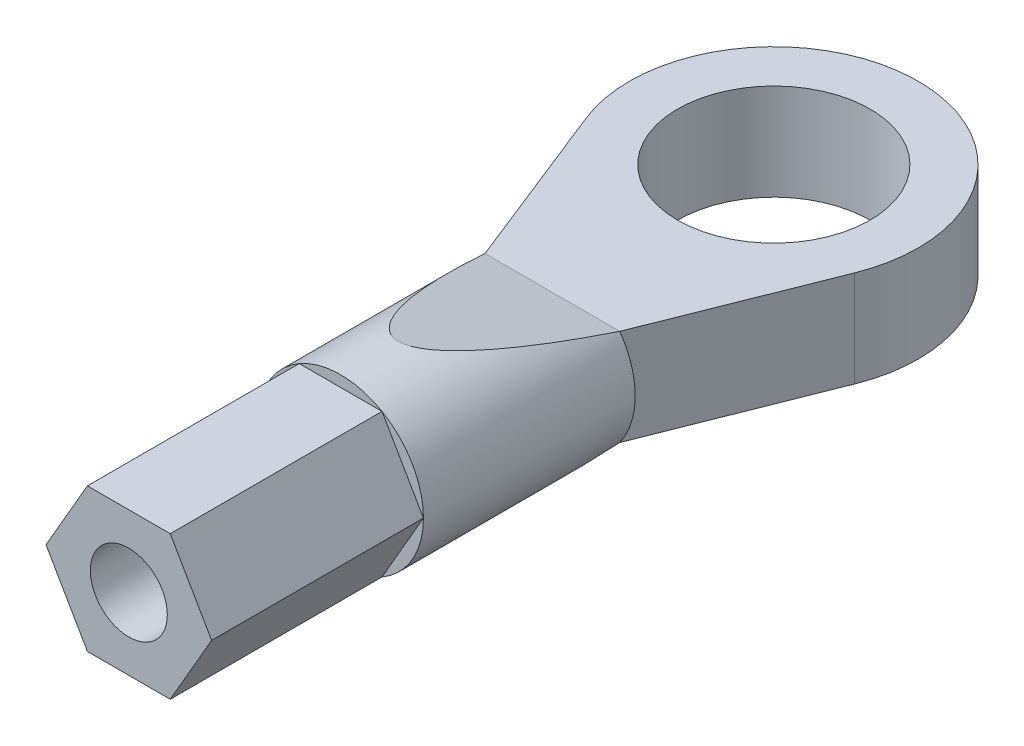
ISO-10303-21;
HEADER;
FILE_DESCRIPTION(('STEP AP214'),'2;1');
FILE_NAME('part.step','',(''),(''),'','','');
FILE_SCHEMA(('AUTOMOTIVE_DESIGN { 1 0 10303 214 1 1 1 1 }'));
ENDSEC;
DATA;
#1=APPLICATION_CONTEXT('core data for automotive mechanical design processes');
#2=APPLICATION_PROTOCOL_DEFINITION('international standard','automotive_design',2000,#1);
#3=PRODUCT_CONTEXT('',#1,'mechanical');
#4=PRODUCT('Part','Part','',(#3));
#5=PRODUCT_RELATED_PRODUCT_CATEGORY('part','',(#4));
#6=PRODUCT_DEFINITION_FORMATION('','',#4);
#7=PRODUCT_DEFINITION_CONTEXT('part definition',#1,'design');
#8=PRODUCT_DEFINITION('design','',#6,#7);
#9=PRODUCT_DEFINITION_SHAPE('','',#8);
#10=(LENGTH_UNIT() NAMED_UNIT(*) SI_UNIT(.MILLI.,.METRE.));
#11=(NAMED_UNIT(*) PLANE_ANGLE_UNIT() SI_UNIT($,.RADIAN.));
#12=(NAMED_UNIT(*) SI_UNIT($,.STERADIAN.) SOLID_ANGLE_UNIT());
#13=UNCERTAINTY_MEASURE_WITH_UNIT(LENGTH_MEASURE(1.E-05),#10,'distance_accuracy_value','');
#14=(GEOMETRIC_REPRESENTATION_CONTEXT(3) GLOBAL_UNCERTAINTY_ASSIGNED_CONTEXT((#13)) GLOBAL_UNIT_ASSIGNED_CONTEXT((#10,
#11,#12)) REPRESENTATION_CONTEXT('',''));
#15=CARTESIAN_POINT('',(0.,0.,0.));
#16=DIRECTION('',(0.,0.,1.));
#17=DIRECTION('',(1.,0.,0.));
#18=AXIS2_PLACEMENT_3D('',#15,#16,#17);
#19=CARTESIAN_POINT('',(0.,1.25,11.25));
#20=DIRECTION('',(0.,0.,1.));
#21=DIRECTION('',(1.,0.,0.));
#22=AXIS2_PLACEMENT_3D('',#19,#20,#21);
#23=PLANE('',#22);
#24=DIRECTION('',(0.499999999999995,0.866025403784441,0.));
#25=VECTOR('',#24,1.);
#26=CARTESIAN_POINT('',(1.07529065838035,-0.612458053218905,11.25));
#27=LINE('',#26,#25);
#28=CARTESIAN_POINT('',(1.07529065838035,-0.612458053218905,11.25));
#29=VERTEX_POINT('',#28);
#30=CARTESIAN_POINT('',(2.15058131676066,1.25,11.25));
#31=VERTEX_POINT('',#30);
#32=EDGE_CURVE('E81',#29,#31,#27,.T.);
#33=ORIENTED_EDGE('',*,*,#32,.F.);
#34=CARTESIAN_POINT('',(0.,1.25,11.25));
#35=DIRECTION('',(0.,0.,1.));
#36=DIRECTION('',(1.,0.,0.));
#37=AXIS2_PLACEMENT_3D('',#34,#35,#36);
#38=CIRCLE('',#37,2.15058131676066);
#39=EDGE_CURVE('E190',#29,#31,#38,.T.);
#40=ORIENTED_EDGE('',*,*,#39,.T.);
#41=EDGE_LOOP('',(#33,#40));
#42=FACE_BOUND('',#41,.T.);
#43=ADVANCED_FACE('F66',(#42),#23,.T.);
#44=DIRECTION('',(1.,0.,0.));
#45=VECTOR('',#44,1.);
#46=CARTESIAN_POINT('',(-1.07529065838031,-0.612458053218927,11.25));
#47=LINE('',#46,#45);
#48=CARTESIAN_POINT('',(-1.07529065838031,-0.612458053218927,11.25));
#49=VERTEX_POINT('',#48);
#50=EDGE_CURVE('E88',#49,#29,#47,.T.);
#51=ORIENTED_EDGE('',*,*,#50,.F.);
#52=EDGE_CURVE('E624',#49,#29,#38,.T.);
#53=ORIENTED_EDGE('',*,*,#52,.T.);
#54=EDGE_LOOP('',(#51,#53));
#55=FACE_BOUND('',#54,.T.);
#56=ADVANCED_FACE('F286',(#55),#23,.T.);
#57=DIRECTION('',(0.500000000000004,-0.866025403784436,0.));
#58=VECTOR('',#57,1.);
#59=CARTESIAN_POINT('',(-2.15058131676066,1.25,11.25));
#60=LINE('',#59,#58);
#61=CARTESIAN_POINT('',(-2.15058131676066,1.25,11.25));
#62=VERTEX_POINT('',#61);
#63=EDGE_CURVE('E352',#62,#49,#60,.T.);
#64=ORIENTED_EDGE('',*,*,#63,.F.);
#65=EDGE_CURVE('E619',#62,#49,#38,.T.);
#66=ORIENTED_EDGE('',*,*,#65,.T.);
#67=EDGE_LOOP('',(#64,#66));
#68=FACE_BOUND('',#67,.T.);
#69=ADVANCED_FACE('F290',(#68),#23,.T.);
#70=DIRECTION('',(-0.499999999999998,-0.86602540378444,0.));
#71=VECTOR('',#70,1.);
#72=CARTESIAN_POINT('',(-1.07529065838034,3.11245805321891,11.25));
#73=LINE('',#72,#71);
#74=CARTESIAN_POINT('',(-1.07529065838034,3.11245805321891,11.25));
#75=VERTEX_POINT('',#74);
#76=EDGE_CURVE('E327',#75,#62,#73,.T.);
#77=ORIENTED_EDGE('',*,*,#76,.F.);
#78=EDGE_CURVE('E623',#75,#62,#38,.T.);
#79=ORIENTED_EDGE('',*,*,#78,.T.);
#80=EDGE_LOOP('',(#77,#79));
#81=FACE_BOUND('',#80,.T.);
#82=ADVANCED_FACE('F309',(#81),#23,.T.);
#83=DIRECTION('',(-1.,0.,0.));
#84=VECTOR('',#83,1.);
#85=CARTESIAN_POINT('',(1.07529065838032,3.11245805321892,11.25));
#86=LINE('',#85,#84);
#87=CARTESIAN_POINT('',(1.07529065838032,3.11245805321892,11.25));
#88=VERTEX_POINT('',#87);
#89=EDGE_CURVE('E321',#88,#75,#86,.T.);
#90=ORIENTED_EDGE('',*,*,#89,.F.);
#91=EDGE_CURVE('E189',#88,#75,#38,.T.);
#92=ORIENTED_EDGE('',*,*,#91,.T.);
#93=EDGE_LOOP('',(#90,#92));
#94=FACE_BOUND('',#93,.T.);
#95=ADVANCED_FACE('F300',(#94),#23,.T.);
#96=CARTESIAN_POINT('',(0.,1.25,11.25));
#97=DIRECTION('',(0.,0.,-1.));
#98=DIRECTION('',(-1.,0.,0.));
#99=AXIS2_PLACEMENT_3D('',#96,#97,#98);
#100=CYLINDRICAL_SURFACE('',#99,2.15058131676066);
#101=EDGE_CURVE('E185',#31,#88,#38,.T.);
#102=ORIENTED_EDGE('',*,*,#101,.F.);
#103=ORIENTED_EDGE('',*,*,#39,.F.);
#104=ORIENTED_EDGE('',*,*,#52,.F.);
#105=ORIENTED_EDGE('',*,*,#65,.F.);
#106=ORIENTED_EDGE('',*,*,#78,.F.);
#107=ORIENTED_EDGE('',*,*,#91,.F.);
#108=EDGE_LOOP('',(#102,#103,#104,#105,#106,#107));
#109=FACE_BOUND('',#108,.T.);
#110=CARTESIAN_POINT('',(0.,1.25,0.198030503247907));
#111=DIRECTION('',(0.,-0.975579383374607,-0.219647141421013));
#112=DIRECTION('',(0.,0.219647141421013,-0.975579383374607));
#113=AXIS2_PLACEMENT_3D('',#110,#111,#112);
#114=ELLIPSE('',#113,9.79107355027437,2.15058131676066);
#115=CARTESIAN_POINT('',(1.75,0.,5.75));
#116=VERTEX_POINT('',#115);
#117=CARTESIAN_POINT('',(-1.75,0.,5.75));
#118=VERTEX_POINT('',#117);
#119=EDGE_CURVE('E176',#116,#118,#114,.T.);
#120=ORIENTED_EDGE('',*,*,#119,.F.);
#121=CARTESIAN_POINT('',(0.,1.25,5.75));
#122=DIRECTION('',(0.,0.,1.));
#123=DIRECTION('',(1.,0.,0.));
#124=AXIS2_PLACEMENT_3D('',#121,#122,#123);
#125=CIRCLE('',#124,2.15058131676066);
#126=CARTESIAN_POINT('',(1.75,2.5,5.75));
#127=VERTEX_POINT('',#126);
#128=EDGE_CURVE('E184',#116,#127,#125,.T.);
#129=ORIENTED_EDGE('',*,*,#128,.T.);
#130=CARTESIAN_POINT('',(0.,1.25,0.198030503247902));
#131=DIRECTION('',(0.,0.975579383374607,-0.219647141421013));
#132=DIRECTION('',(0.,-0.219647141421013,-0.975579383374607));
#133=AXIS2_PLACEMENT_3D('',#130,#131,#132);
#134=ELLIPSE('',#133,9.79107355027438,2.15058131676066);
#135=CARTESIAN_POINT('',(-1.75,2.5,5.75));
#136=VERTEX_POINT('',#135);
#137=EDGE_CURVE('E172',#136,#127,#134,.T.);
#138=ORIENTED_EDGE('',*,*,#137,.F.);
#139=EDGE_CURVE('E194',#136,#118,#125,.T.);
#140=ORIENTED_EDGE('',*,*,#139,.T.);
#141=EDGE_LOOP('',(#120,#129,#138,#140));
#142=FACE_BOUND('',#141,.T.);
#143=ADVANCED_FACE('F255',(#109,#142),#100,.T.);
#144=CARTESIAN_POINT('',(-3.48484494320039,2.5,1.38504719119988));
#145=DIRECTION('',(-0.929291984853437,0.,0.369345917653302));
#146=DIRECTION('',(0.369345917653302,0.,0.929291984853437));
#147=AXIS2_PLACEMENT_3D('',#144,#145,#146);
#148=PLANE('',#147);
#149=DIRECTION('',(-0.369345917653302,0.,-0.929291984853437));
#150=VECTOR('',#149,1.);
#151=CARTESIAN_POINT('',(-3.48484494320039,0.,1.38504719119988));
#152=LINE('',#151,#150);
#153=CARTESIAN_POINT('',(-3.48484494320039,0.,1.38504719119988));
#154=VERTEX_POINT('',#153);
#155=EDGE_CURVE('E188',#118,#154,#152,.T.);
#156=ORIENTED_EDGE('',*,*,#155,.F.);
#157=DIRECTION('',(0.,-1.,0.));
#158=VECTOR('',#157,1.);
#159=CARTESIAN_POINT('',(-1.75,2.5,5.75));
#160=LINE('',#159,#158);
#161=EDGE_CURVE('E12',#136,#118,#160,.T.);
#162=ORIENTED_EDGE('',*,*,#161,.F.);
#163=DIRECTION('',(-0.369345917653302,0.,-0.929291984853437));
#164=VECTOR('',#163,1.);
#165=CARTESIAN_POINT('',(-3.48484494320039,2.5,1.38504719119988));
#166=LINE('',#165,#164);
#167=CARTESIAN_POINT('',(-3.48484494320039,2.5,1.38504719119988));
#168=VERTEX_POINT('',#167);
#169=EDGE_CURVE('E195',#136,#168,#166,.T.);
#170=ORIENTED_EDGE('',*,*,#169,.T.);
#171=DIRECTION('',(0.,-1.,0.));
#172=VECTOR('',#171,1.);
#173=CARTESIAN_POINT('',(-3.48484494320039,2.5,1.38504719119988));
#174=LINE('',#173,#172);
#175=EDGE_CURVE('E214',#168,#154,#174,.T.);
#176=ORIENTED_EDGE('',*,*,#175,.T.);
#177=EDGE_LOOP('',(#156,#162,#170,#176));
#178=FACE_BOUND('',#177,.T.);
#179=ADVANCED_FACE('F68',(#178),#148,.T.);
#180=CARTESIAN_POINT('',(3.48484494320039,2.5,1.38504719119988));
#181=DIRECTION('',(-0.929291984853437,0.,-0.369345917653302));
#182=DIRECTION('',(-0.369345917653302,0.,0.929291984853437));
#183=AXIS2_PLACEMENT_3D('',#180,#181,#182);
#184=PLANE('',#183);
#185=DIRECTION('',(0.369345917653302,0.,-0.929291984853437));
#186=VECTOR('',#185,1.);
#187=CARTESIAN_POINT('',(3.48484494320039,0.,1.38504719119988));
#188=LINE('',#187,#186);
#189=CARTESIAN_POINT('',(3.48484494320039,0.,1.38504719119988));
#190=VERTEX_POINT('',#189);
#191=EDGE_CURVE('E221',#116,#190,#188,.T.);
#192=ORIENTED_EDGE('',*,*,#191,.T.);
#193=DIRECTION('',(0.,-1.,0.));
#194=VECTOR('',#193,1.);
#195=CARTESIAN_POINT('',(3.48484494320039,2.5,1.38504719119988));
#196=LINE('',#195,#194);
#197=CARTESIAN_POINT('',(3.48484494320039,2.5,1.38504719119988));
#198=VERTEX_POINT('',#197);
#199=EDGE_CURVE('E233',#198,#190,#196,.T.);
#200=ORIENTED_EDGE('',*,*,#199,.F.);
#201=DIRECTION('',(0.369345917653302,0.,-0.929291984853437));
#202=VECTOR('',#201,1.);
#203=CARTESIAN_POINT('',(3.48484494320039,2.5,1.38504719119988));
#204=LINE('',#203,#202);
#205=EDGE_CURVE('E204',#127,#198,#204,.T.);
#206=ORIENTED_EDGE('',*,*,#205,.F.);
#207=DIRECTION('',(0.,-1.,0.));
#208=VECTOR('',#207,1.);
#209=CARTESIAN_POINT('',(1.75,2.5,5.75));
#210=LINE('',#209,#208);
#211=EDGE_CURVE('E75',#127,#116,#210,.T.);
#212=ORIENTED_EDGE('',*,*,#211,.T.);
#213=EDGE_LOOP('',(#192,#200,#206,#212));
#214=FACE_BOUND('',#213,.T.);
#215=ADVANCED_FACE('F242',(#214),#184,.F.);
#216=CARTESIAN_POINT('',(0.,2.5,0.));
#217=DIRECTION('',(0.,-1.,0.));
#218=DIRECTION('',(0.,0.,-1.));
#219=AXIS2_PLACEMENT_3D('',#216,#217,#218);
#220=CYLINDRICAL_SURFACE('',#219,3.75);
#221=CARTESIAN_POINT('',(0.,0.,0.));
#222=DIRECTION('',(0.,1.,0.));
#223=DIRECTION('',(0.,0.,1.));
#224=AXIS2_PLACEMENT_3D('',#221,#222,#223);
#225=CIRCLE('',#224,3.75);
#226=EDGE_CURVE('E224',#190,#154,#225,.T.);
#227=ORIENTED_EDGE('',*,*,#226,.T.);
#228=ORIENTED_EDGE('',*,*,#175,.F.);
#229=CARTESIAN_POINT('',(0.,2.5,0.));
#230=DIRECTION('',(0.,1.,0.));
#231=DIRECTION('',(0.,0.,1.));
#232=AXIS2_PLACEMENT_3D('',#229,#230,#231);
#233=CIRCLE('',#232,3.75);
#234=EDGE_CURVE('E207',#198,#168,#233,.T.);
#235=ORIENTED_EDGE('',*,*,#234,.F.);
#236=ORIENTED_EDGE('',*,*,#199,.T.);
#237=EDGE_LOOP('',(#227,#228,#235,#236));
#238=FACE_BOUND('',#237,.T.);
#239=ADVANCED_FACE('F267',(#238),#220,.T.);
#240=CARTESIAN_POINT('',(0.,2.5,0.));
#241=DIRECTION('',(0.,-1.,0.));
#242=DIRECTION('',(0.,0.,-1.));
#243=AXIS2_PLACEMENT_3D('',#240,#241,#242);
#244=CYLINDRICAL_SURFACE('',#243,2.5);
#245=CARTESIAN_POINT('',(0.,2.5,0.));
#246=DIRECTION('',(0.,1.,0.));
#247=DIRECTION('',(0.,0.,1.));
#248=AXIS2_PLACEMENT_3D('',#245,#246,#247);
#249=CIRCLE('',#248,2.5);
#250=CARTESIAN_POINT('',(0.,2.5,2.5));
#251=VERTEX_POINT('',#250);
#252=EDGE_CURVE('E210',#251,#251,#249,.T.);
#253=ORIENTED_EDGE('',*,*,#252,.T.);
#254=EDGE_LOOP('',(#253));
#255=FACE_BOUND('',#254,.T.);
#256=CARTESIAN_POINT('',(0.,0.,0.));
#257=DIRECTION('',(0.,1.,0.));
#258=DIRECTION('',(0.,0.,1.));
#259=AXIS2_PLACEMENT_3D('',#256,#257,#258);
#260=CIRCLE('',#259,2.5);
#261=CARTESIAN_POINT('',(0.,0.,2.5));
#262=VERTEX_POINT('',#261);
#263=EDGE_CURVE('E200',#262,#262,#260,.T.);
#264=ORIENTED_EDGE('',*,*,#263,.F.);
#265=EDGE_LOOP('',(#264));
#266=FACE_BOUND('',#265,.T.);
#267=ADVANCED_FACE('F483',(#255,#266),#244,.F.);
#268=CARTESIAN_POINT('',(0.,2.5,0.));
#269=DIRECTION('',(0.,1.,0.));
#270=DIRECTION('',(0.,0.,1.));
#271=AXIS2_PLACEMENT_3D('',#268,#269,#270);
#272=PLANE('',#271);
#273=ORIENTED_EDGE('',*,*,#169,.F.);
#274=DIRECTION('',(1.,0.,0.));
#275=VECTOR('',#274,1.);
#276=CARTESIAN_POINT('',(0.,2.5,5.75));
#277=LINE('',#276,#275);
#278=EDGE_CURVE('E199',#136,#127,#277,.T.);
#279=ORIENTED_EDGE('',*,*,#278,.T.);
#280=ORIENTED_EDGE('',*,*,#205,.T.);
#281=ORIENTED_EDGE('',*,*,#234,.T.);
#282=EDGE_LOOP('',(#273,#279,#280,#281));
#283=FACE_BOUND('',#282,.T.);
#284=ORIENTED_EDGE('',*,*,#252,.F.);
#285=EDGE_LOOP('',(#284));
#286=FACE_BOUND('',#285,.T.);
#287=ADVANCED_FACE('F269',(#283,#286),#272,.T.);
#288=CARTESIAN_POINT('',(0.,0.,0.));
#289=DIRECTION('',(0.,1.,0.));
#290=DIRECTION('',(0.,0.,1.));
#291=AXIS2_PLACEMENT_3D('',#288,#289,#290);
#292=PLANE('',#291);
#293=ORIENTED_EDGE('',*,*,#155,.T.);
#294=ORIENTED_EDGE('',*,*,#226,.F.);
#295=ORIENTED_EDGE('',*,*,#191,.F.);
#296=DIRECTION('',(1.,0.,0.));
#297=VECTOR('',#296,1.);
#298=CARTESIAN_POINT('',(0.,0.,5.75));
#299=LINE('',#298,#297);
#300=EDGE_CURVE('E218',#118,#116,#299,.T.);
#301=ORIENTED_EDGE('',*,*,#300,.F.);
#302=EDGE_LOOP('',(#293,#294,#295,#301));
#303=FACE_BOUND('',#302,.T.);
#304=ORIENTED_EDGE('',*,*,#263,.T.);
#305=EDGE_LOOP('',(#304));
#306=FACE_BOUND('',#305,.T.);
#307=ADVANCED_FACE('F249',(#303,#306),#292,.F.);
#308=CARTESIAN_POINT('',(0.,1.25,5.75));
#309=DIRECTION('',(0.,0.,1.));
#310=DIRECTION('',(1.,0.,0.));
#311=AXIS2_PLACEMENT_3D('',#308,#309,#310);
#312=PLANE('',#311);
#313=ORIENTED_EDGE('',*,*,#211,.F.);
#314=ORIENTED_EDGE('',*,*,#128,.F.);
#315=EDGE_LOOP('',(#313,#314));
#316=FACE_BOUND('',#315,.T.);
#317=ADVANCED_FACE('F251',(#316),#312,.F.);
#318=DIRECTION('',(-0.500000000000001,0.866025403784438,0.));
#319=VECTOR('',#318,1.);
#320=CARTESIAN_POINT('',(2.15058131676066,1.25,11.25));
#321=LINE('',#320,#319);
#322=EDGE_CURVE('E328',#31,#88,#321,.T.);
#323=ORIENTED_EDGE('',*,*,#322,.F.);
#324=ORIENTED_EDGE('',*,*,#101,.T.);
#325=EDGE_LOOP('',(#323,#324));
#326=FACE_BOUND('',#325,.T.);
#327=ADVANCED_FACE('F281',(#326),#23,.T.);
#328=ORIENTED_EDGE('',*,*,#139,.F.);
#329=ORIENTED_EDGE('',*,*,#161,.T.);
#330=EDGE_LOOP('',(#328,#329));
#331=FACE_BOUND('',#330,.T.);
#332=ADVANCED_FACE('F274',(#331),#312,.F.);
#333=CARTESIAN_POINT('',(5.5,1.14725930213578,-0.258300073245838));
#334=DIRECTION('',(0.,0.975579383374607,-0.219647141421013));
#335=DIRECTION('',(0.,0.219647141421013,0.975579383374607));
#336=AXIS2_PLACEMENT_3D('',#333,#334,#335);
#337=PLANE('',#336);
#338=ORIENTED_EDGE('',*,*,#137,.T.);
#339=ORIENTED_EDGE('',*,*,#278,.F.);
#340=EDGE_LOOP('',(#338,#339));
#341=FACE_BOUND('',#340,.T.);
#342=ADVANCED_FACE('F272',(#341),#337,.T.);
#343=CARTESIAN_POINT('',(5.5,1.23212853102817,0.27740798372293));
#344=DIRECTION('',(0.,-0.975579383374607,-0.219647141421013));
#345=DIRECTION('',(0.,0.219647141421013,-0.975579383374607));
#346=AXIS2_PLACEMENT_3D('',#343,#344,#345);
#347=PLANE('',#346);
#348=ORIENTED_EDGE('',*,*,#119,.T.);
#349=ORIENTED_EDGE('',*,*,#300,.T.);
#350=EDGE_LOOP('',(#348,#349));
#351=FACE_BOUND('',#350,.T.);
#352=ADVANCED_FACE('F261',(#351),#347,.T.);
#353=CARTESIAN_POINT('',(0.,0.,16.75));
#354=DIRECTION('',(0.,0.,1.));
#355=DIRECTION('',(1.,0.,0.));
#356=AXIS2_PLACEMENT_3D('',#353,#354,#355);
#357=PLANE('',#356);
#358=DIRECTION('',(0.499999999999995,0.866025403784441,0.));
#359=VECTOR('',#358,1.);
#360=CARTESIAN_POINT('',(1.07529065838035,-0.612458053218905,16.75));
#361=LINE('',#360,#359);
#362=CARTESIAN_POINT('',(1.07529065838035,-0.612458053218905,16.75));
#363=VERTEX_POINT('',#362);
#364=CARTESIAN_POINT('',(2.15058131676066,1.25,16.75));
#365=VERTEX_POINT('',#364);
#366=EDGE_CURVE('E158',#363,#365,#361,.T.);
#367=ORIENTED_EDGE('',*,*,#366,.T.);
#368=DIRECTION('',(-0.500000000000001,0.866025403784438,0.));
#369=VECTOR('',#368,1.);
#370=CARTESIAN_POINT('',(2.15058131676066,1.25,16.75));
#371=LINE('',#370,#369);
#372=CARTESIAN_POINT('',(1.07529065838032,3.11245805321892,16.75));
#373=VERTEX_POINT('',#372);
#374=EDGE_CURVE('E146',#365,#373,#371,.T.);
#375=ORIENTED_EDGE('',*,*,#374,.T.);
#376=DIRECTION('',(-1.,0.,0.));
#377=VECTOR('',#376,1.);
#378=CARTESIAN_POINT('',(1.07529065838032,3.11245805321892,16.75));
#379=LINE('',#378,#377);
#380=CARTESIAN_POINT('',(-1.07529065838034,3.11245805321891,16.75));
#381=VERTEX_POINT('',#380);
#382=EDGE_CURVE('E157',#373,#381,#379,.T.);
#383=ORIENTED_EDGE('',*,*,#382,.T.);
#384=DIRECTION('',(-0.499999999999998,-0.86602540378444,0.));
#385=VECTOR('',#384,1.);
#386=CARTESIAN_POINT('',(-1.07529065838034,3.11245805321891,16.75));
#387=LINE('',#386,#385);
#388=CARTESIAN_POINT('',(-2.15058131676066,1.25,16.75));
#389=VERTEX_POINT('',#388);
#390=EDGE_CURVE('E335',#381,#389,#387,.T.);
#391=ORIENTED_EDGE('',*,*,#390,.T.);
#392=DIRECTION('',(0.500000000000004,-0.866025403784436,0.));
#393=VECTOR('',#392,1.);
#394=CARTESIAN_POINT('',(-2.15058131676066,1.25,16.75));
#395=LINE('',#394,#393);
#396=CARTESIAN_POINT('',(-1.07529065838031,-0.612458053218927,16.75));
#397=VERTEX_POINT('',#396);
#398=EDGE_CURVE('E338',#389,#397,#395,.T.);
#399=ORIENTED_EDGE('',*,*,#398,.T.);
#400=DIRECTION('',(1.,0.,0.));
#401=VECTOR('',#400,1.);
#402=CARTESIAN_POINT('',(-1.07529065838031,-0.612458053218927,16.75));
#403=LINE('',#402,#401);
#404=EDGE_CURVE('E164',#397,#363,#403,.T.);
#405=ORIENTED_EDGE('',*,*,#404,.T.);
#406=EDGE_LOOP('',(#367,#375,#383,#391,#399,#405));
#407=FACE_BOUND('',#406,.T.);
#408=CARTESIAN_POINT('',(0.,1.25,16.75));
#409=DIRECTION('',(0.,0.,1.));
#410=DIRECTION('',(1.,0.,0.));
#411=AXIS2_PLACEMENT_3D('',#408,#409,#410);
#412=CIRCLE('',#411,1.);
#413=CARTESIAN_POINT('',(1.,1.25,16.75));
#414=VERTEX_POINT('',#413);
#415=EDGE_CURVE('E347',#414,#414,#412,.T.);
#416=ORIENTED_EDGE('',*,*,#415,.F.);
#417=EDGE_LOOP('',(#416));
#418=FACE_BOUND('',#417,.T.);
#419=ADVANCED_FACE('F161',(#407,#418),#357,.T.);
#420=CARTESIAN_POINT('',(1.07529065838035,-0.612458053218905,16.75));
#421=DIRECTION('',(-0.866025403784441,0.499999999999995,0.));
#422=DIRECTION('',(-0.499999999999995,-0.866025403784441,0.));
#423=AXIS2_PLACEMENT_3D('',#420,#421,#422);
#424=PLANE('',#423);
#425=ORIENTED_EDGE('',*,*,#32,.T.);
#426=DIRECTION('',(0.,0.,-1.));
#427=VECTOR('',#426,1.);
#428=CARTESIAN_POINT('',(2.15058131676066,1.25,16.75));
#429=LINE('',#428,#427);
#430=EDGE_CURVE('E151',#365,#31,#429,.T.);
#431=ORIENTED_EDGE('',*,*,#430,.F.);
#432=ORIENTED_EDGE('',*,*,#366,.F.);
#433=DIRECTION('',(0.,0.,-1.));
#434=VECTOR('',#433,1.);
#435=CARTESIAN_POINT('',(1.07529065838035,-0.612458053218905,16.75));
#436=LINE('',#435,#434);
#437=EDGE_CURVE('E345',#363,#29,#436,.T.);
#438=ORIENTED_EDGE('',*,*,#437,.T.);
#439=EDGE_LOOP('',(#425,#431,#432,#438));
#440=FACE_BOUND('',#439,.T.);
#441=ADVANCED_FACE('F170',(#440),#424,.F.);
#442=CARTESIAN_POINT('',(2.15058131676066,1.25,16.75));
#443=DIRECTION('',(-0.866025403784438,-0.500000000000001,0.));
#444=DIRECTION('',(0.500000000000001,-0.866025403784438,0.));
#445=AXIS2_PLACEMENT_3D('',#442,#443,#444);
#446=PLANE('',#445);
#447=ORIENTED_EDGE('',*,*,#322,.T.);
#448=DIRECTION('',(0.,0.,-1.));
#449=VECTOR('',#448,1.);
#450=CARTESIAN_POINT('',(1.07529065838032,3.11245805321892,16.75));
#451=LINE('',#450,#449);
#452=EDGE_CURVE('E153',#373,#88,#451,.T.);
#453=ORIENTED_EDGE('',*,*,#452,.F.);
#454=ORIENTED_EDGE('',*,*,#374,.F.);
#455=ORIENTED_EDGE('',*,*,#430,.T.);
#456=EDGE_LOOP('',(#447,#453,#454,#455));
#457=FACE_BOUND('',#456,.T.);
#458=ADVANCED_FACE('F149',(#457),#446,.F.);
#459=CARTESIAN_POINT('',(1.07529065838032,3.11245805321892,16.75));
#460=DIRECTION('',(0.,-1.,0.));
#461=DIRECTION('',(1.,0.,0.));
#462=AXIS2_PLACEMENT_3D('',#459,#460,#461);
#463=PLANE('',#462);
#464=ORIENTED_EDGE('',*,*,#89,.T.);
#465=DIRECTION('',(0.,0.,-1.));
#466=VECTOR('',#465,1.);
#467=CARTESIAN_POINT('',(-1.07529065838034,3.11245805321891,16.75));
#468=LINE('',#467,#466);
#469=EDGE_CURVE('E178',#381,#75,#468,.T.);
#470=ORIENTED_EDGE('',*,*,#469,.F.);
#471=ORIENTED_EDGE('',*,*,#382,.F.);
#472=ORIENTED_EDGE('',*,*,#452,.T.);
#473=EDGE_LOOP('',(#464,#470,#471,#472));
#474=FACE_BOUND('',#473,.T.);
#475=ADVANCED_FACE('F332',(#474),#463,.F.);
#476=CARTESIAN_POINT('',(-1.07529065838034,3.11245805321891,16.75));
#477=DIRECTION('',(0.86602540378444,-0.499999999999998,0.));
#478=DIRECTION('',(0.499999999999998,0.86602540378444,0.));
#479=AXIS2_PLACEMENT_3D('',#476,#477,#478);
#480=PLANE('',#479);
#481=ORIENTED_EDGE('',*,*,#76,.T.);
#482=DIRECTION('',(0.,0.,-1.));
#483=VECTOR('',#482,1.);
#484=CARTESIAN_POINT('',(-2.15058131676066,1.25,16.75));
#485=LINE('',#484,#483);
#486=EDGE_CURVE('E364',#389,#62,#485,.T.);
#487=ORIENTED_EDGE('',*,*,#486,.F.);
#488=ORIENTED_EDGE('',*,*,#390,.F.);
#489=ORIENTED_EDGE('',*,*,#469,.T.);
#490=EDGE_LOOP('',(#481,#487,#488,#489));
#491=FACE_BOUND('',#490,.T.);
#492=ADVANCED_FACE('F369',(#491),#480,.F.);
#493=CARTESIAN_POINT('',(-2.15058131676066,1.25,16.75));
#494=DIRECTION('',(0.866025403784436,0.500000000000004,0.));
#495=DIRECTION('',(-0.500000000000004,0.866025403784436,0.));
#496=AXIS2_PLACEMENT_3D('',#493,#494,#495);
#497=PLANE('',#496);
#498=ORIENTED_EDGE('',*,*,#63,.T.);
#499=DIRECTION('',(0.,0.,-1.));
#500=VECTOR('',#499,1.);
#501=CARTESIAN_POINT('',(-1.07529065838031,-0.612458053218927,16.75));
#502=LINE('',#501,#500);
#503=EDGE_CURVE('E360',#397,#49,#502,.T.);
#504=ORIENTED_EDGE('',*,*,#503,.F.);
#505=ORIENTED_EDGE('',*,*,#398,.F.);
#506=ORIENTED_EDGE('',*,*,#486,.T.);
#507=EDGE_LOOP('',(#498,#504,#505,#506));
#508=FACE_BOUND('',#507,.T.);
#509=ADVANCED_FACE('F374',(#508),#497,.F.);
#510=CARTESIAN_POINT('',(-1.07529065838031,-0.612458053218927,16.75));
#511=DIRECTION('',(0.,1.,0.));
#512=DIRECTION('',(-1.,0.,0.));
#513=AXIS2_PLACEMENT_3D('',#510,#511,#512);
#514=PLANE('',#513);
#515=ORIENTED_EDGE('',*,*,#50,.T.);
#516=ORIENTED_EDGE('',*,*,#437,.F.);
#517=ORIENTED_EDGE('',*,*,#404,.F.);
#518=ORIENTED_EDGE('',*,*,#503,.T.);
#519=EDGE_LOOP('',(#515,#516,#517,#518));
#520=FACE_BOUND('',#519,.T.);
#521=ADVANCED_FACE('F304',(#520),#514,.F.);
#522=CARTESIAN_POINT('',(0.,1.25,16.75));
#523=DIRECTION('',(0.,0.,-1.));
#524=DIRECTION('',(-1.,0.,0.));
#525=AXIS2_PLACEMENT_3D('',#522,#523,#524);
#526=CYLINDRICAL_SURFACE('',#525,1.);
#527=ORIENTED_EDGE('',*,*,#415,.T.);
#528=EDGE_LOOP('',(#527));
#529=FACE_BOUND('',#528,.T.);
#530=CARTESIAN_POINT('',(0.,1.25,11.25));
#531=DIRECTION('',(0.,0.,1.));
#532=DIRECTION('',(1.,0.,0.));
#533=AXIS2_PLACEMENT_3D('',#530,#531,#532);
#534=CIRCLE('',#533,1.);
#535=CARTESIAN_POINT('',(1.,1.25,11.25));
#536=VERTEX_POINT('',#535);
#537=EDGE_CURVE('E634',#536,#536,#534,.T.);
#538=ORIENTED_EDGE('',*,*,#537,.F.);
#539=EDGE_LOOP('',(#538));
#540=FACE_BOUND('',#539,.T.);
#541=ADVANCED_FACE('F298',(#529,#540),#526,.F.);
#542=ORIENTED_EDGE('',*,*,#537,.T.);
#543=EDGE_LOOP('',(#542));
#544=FACE_BOUND('',#543,.T.);
#545=ADVANCED_FACE('F293',(#544),#23,.T.);
#546=CLOSED_SHELL('',(#43,#56,#69,#82,#95,#143,#179,#215,#239,#267,#287,#307,#317,#327,#332,
#342,#352,#419,#441,#458,#475,#492,#509,#521,#541,#545));
#547=MANIFOLD_SOLID_BREP('B2',#546);
#548=ADVANCED_BREP_SHAPE_REPRESENTATION('',(#18,#547),#14);
#549=SHAPE_DEFINITION_REPRESENTATION(#9,#548);
ENDSEC;
END-ISO-10303-21;
